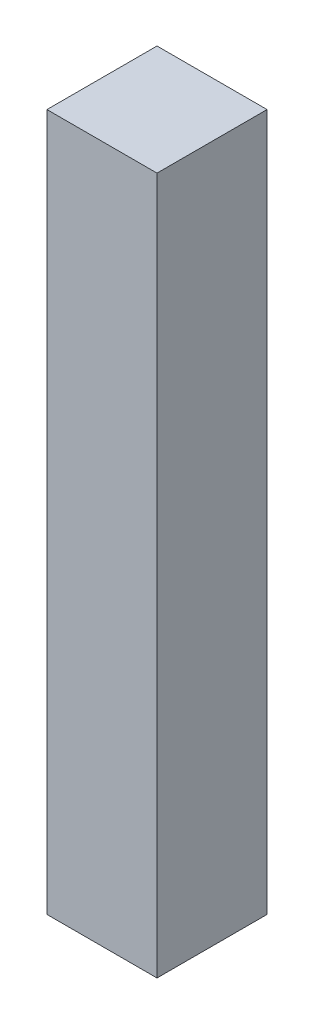
ISO-10303-21;
HEADER;
FILE_DESCRIPTION(('STEP AP214'),'2;1');
FILE_NAME('part.step','',(''),(''),'','','');
FILE_SCHEMA(('AUTOMOTIVE_DESIGN { 1 0 10303 214 1 1 1 1 }'));
ENDSEC;
DATA;
#1=APPLICATION_CONTEXT('core data for automotive mechanical design processes');
#2=APPLICATION_PROTOCOL_DEFINITION('international standard','automotive_design',2000,#1);
#3=PRODUCT_CONTEXT('',#1,'mechanical');
#4=PRODUCT('Part','Part','',(#3));
#5=PRODUCT_RELATED_PRODUCT_CATEGORY('part','',(#4));
#6=PRODUCT_DEFINITION_FORMATION('','',#4);
#7=PRODUCT_DEFINITION_CONTEXT('part definition',#1,'design');
#8=PRODUCT_DEFINITION('design','',#6,#7);
#9=PRODUCT_DEFINITION_SHAPE('','',#8);
#10=(LENGTH_UNIT() NAMED_UNIT(*) SI_UNIT(.MILLI.,.METRE.));
#11=(NAMED_UNIT(*) PLANE_ANGLE_UNIT() SI_UNIT($,.RADIAN.));
#12=(NAMED_UNIT(*) SI_UNIT($,.STERADIAN.) SOLID_ANGLE_UNIT());
#13=UNCERTAINTY_MEASURE_WITH_UNIT(LENGTH_MEASURE(1.E-05),#10,'distance_accuracy_value','');
#14=(GEOMETRIC_REPRESENTATION_CONTEXT(3) GLOBAL_UNCERTAINTY_ASSIGNED_CONTEXT((#13)) GLOBAL_UNIT_ASSIGNED_CONTEXT((#10,
#11,#12)) REPRESENTATION_CONTEXT('',''));
#15=CARTESIAN_POINT('',(0.,0.,0.));
#16=DIRECTION('',(0.,0.,1.));
#17=DIRECTION('',(1.,0.,0.));
#18=AXIS2_PLACEMENT_3D('',#15,#16,#17);
#19=CARTESIAN_POINT('',(15.,190.,15.));
#20=DIRECTION('',(-1.,0.,0.));
#21=DIRECTION('',(0.,0.,1.));
#22=AXIS2_PLACEMENT_3D('',#19,#20,#21);
#23=PLANE('',#22);
#24=DIRECTION('',(0.,0.,-1.));
#25=VECTOR('',#24,1.);
#26=CARTESIAN_POINT('',(15.,0.,15.));
#27=LINE('',#26,#25);
#28=CARTESIAN_POINT('',(15.,0.,15.));
#29=VERTEX_POINT('',#28);
#30=CARTESIAN_POINT('',(15.,0.,-15.));
#31=VERTEX_POINT('',#30);
#32=EDGE_CURVE('E96',#29,#31,#27,.T.);
#33=ORIENTED_EDGE('',*,*,#32,.T.);
#34=DIRECTION('',(0.,-1.,0.));
#35=VECTOR('',#34,1.);
#36=CARTESIAN_POINT('',(15.,190.,-15.));
#37=LINE('',#36,#35);
#38=CARTESIAN_POINT('',(15.,190.,-15.));
#39=VERTEX_POINT('',#38);
#40=EDGE_CURVE('E11',#39,#31,#37,.T.);
#41=ORIENTED_EDGE('',*,*,#40,.F.);
#42=DIRECTION('',(0.,0.,-1.));
#43=VECTOR('',#42,1.);
#44=CARTESIAN_POINT('',(15.,190.,15.));
#45=LINE('',#44,#43);
#46=CARTESIAN_POINT('',(15.,190.,15.));
#47=VERTEX_POINT('',#46);
#48=EDGE_CURVE('E84',#47,#39,#45,.T.);
#49=ORIENTED_EDGE('',*,*,#48,.F.);
#50=DIRECTION('',(0.,-1.,0.));
#51=VECTOR('',#50,1.);
#52=CARTESIAN_POINT('',(15.,190.,15.));
#53=LINE('',#52,#51);
#54=EDGE_CURVE('E92',#47,#29,#53,.T.);
#55=ORIENTED_EDGE('',*,*,#54,.T.);
#56=EDGE_LOOP('',(#33,#41,#49,#55));
#57=FACE_BOUND('',#56,.T.);
#58=ADVANCED_FACE('F33',(#57),#23,.F.);
#59=CARTESIAN_POINT('',(-15.,190.,-15.));
#60=DIRECTION('',(0.,0.,1.));
#61=DIRECTION('',(1.,0.,0.));
#62=AXIS2_PLACEMENT_3D('',#59,#60,#61);
#63=PLANE('',#62);
#64=DIRECTION('',(-1.,0.,0.));
#65=VECTOR('',#64,1.);
#66=CARTESIAN_POINT('',(-15.,0.,-15.));
#67=LINE('',#66,#65);
#68=CARTESIAN_POINT('',(-15.,0.,-15.));
#69=VERTEX_POINT('',#68);
#70=EDGE_CURVE('E88',#31,#69,#67,.T.);
#71=ORIENTED_EDGE('',*,*,#70,.T.);
#72=DIRECTION('',(0.,-1.,0.));
#73=VECTOR('',#72,1.);
#74=CARTESIAN_POINT('',(-15.,190.,-15.));
#75=LINE('',#74,#73);
#76=CARTESIAN_POINT('',(-15.,190.,-15.));
#77=VERTEX_POINT('',#76);
#78=EDGE_CURVE('E41',#77,#69,#75,.T.);
#79=ORIENTED_EDGE('',*,*,#78,.F.);
#80=DIRECTION('',(-1.,0.,0.));
#81=VECTOR('',#80,1.);
#82=CARTESIAN_POINT('',(-15.,190.,-15.));
#83=LINE('',#82,#81);
#84=EDGE_CURVE('E79',#39,#77,#83,.T.);
#85=ORIENTED_EDGE('',*,*,#84,.F.);
#86=ORIENTED_EDGE('',*,*,#40,.T.);
#87=EDGE_LOOP('',(#71,#79,#85,#86));
#88=FACE_BOUND('',#87,.T.);
#89=ADVANCED_FACE('F87',(#88),#63,.F.);
#90=CARTESIAN_POINT('',(-15.,190.,15.));
#91=DIRECTION('',(1.,0.,0.));
#92=DIRECTION('',(0.,0.,-1.));
#93=AXIS2_PLACEMENT_3D('',#90,#91,#92);
#94=PLANE('',#93);
#95=DIRECTION('',(0.,0.,1.));
#96=VECTOR('',#95,1.);
#97=CARTESIAN_POINT('',(-15.,0.,15.));
#98=LINE('',#97,#96);
#99=CARTESIAN_POINT('',(-15.,0.,15.));
#100=VERTEX_POINT('',#99);
#101=EDGE_CURVE('E66',#69,#100,#98,.T.);
#102=ORIENTED_EDGE('',*,*,#101,.T.);
#103=DIRECTION('',(0.,-1.,0.));
#104=VECTOR('',#103,1.);
#105=CARTESIAN_POINT('',(-15.,190.,15.));
#106=LINE('',#105,#104);
#107=CARTESIAN_POINT('',(-15.,190.,15.));
#108=VERTEX_POINT('',#107);
#109=EDGE_CURVE('E89',#108,#100,#106,.T.);
#110=ORIENTED_EDGE('',*,*,#109,.F.);
#111=DIRECTION('',(0.,0.,1.));
#112=VECTOR('',#111,1.);
#113=CARTESIAN_POINT('',(-15.,190.,15.));
#114=LINE('',#113,#112);
#115=EDGE_CURVE('E82',#77,#108,#114,.T.);
#116=ORIENTED_EDGE('',*,*,#115,.F.);
#117=ORIENTED_EDGE('',*,*,#78,.T.);
#118=EDGE_LOOP('',(#102,#110,#116,#117));
#119=FACE_BOUND('',#118,.T.);
#120=ADVANCED_FACE('F90',(#119),#94,.F.);
#121=CARTESIAN_POINT('',(-15.,190.,15.));
#122=DIRECTION('',(0.,0.,-1.));
#123=DIRECTION('',(-1.,0.,0.));
#124=AXIS2_PLACEMENT_3D('',#121,#122,#123);
#125=PLANE('',#124);
#126=DIRECTION('',(1.,0.,0.));
#127=VECTOR('',#126,1.);
#128=CARTESIAN_POINT('',(-15.,0.,15.));
#129=LINE('',#128,#127);
#130=EDGE_CURVE('E72',#100,#29,#129,.T.);
#131=ORIENTED_EDGE('',*,*,#130,.T.);
#132=ORIENTED_EDGE('',*,*,#54,.F.);
#133=DIRECTION('',(1.,0.,0.));
#134=VECTOR('',#133,1.);
#135=CARTESIAN_POINT('',(-15.,190.,15.));
#136=LINE('',#135,#134);
#137=EDGE_CURVE('E49',#108,#47,#136,.T.);
#138=ORIENTED_EDGE('',*,*,#137,.F.);
#139=ORIENTED_EDGE('',*,*,#109,.T.);
#140=EDGE_LOOP('',(#131,#132,#138,#139));
#141=FACE_BOUND('',#140,.T.);
#142=ADVANCED_FACE('F103',(#141),#125,.F.);
#143=CARTESIAN_POINT('',(0.,190.,0.));
#144=DIRECTION('',(0.,-1.,0.));
#145=DIRECTION('',(0.,0.,-1.));
#146=AXIS2_PLACEMENT_3D('',#143,#144,#145);
#147=PLANE('',#146);
#148=ORIENTED_EDGE('',*,*,#48,.T.);
#149=ORIENTED_EDGE('',*,*,#84,.T.);
#150=ORIENTED_EDGE('',*,*,#115,.T.);
#151=ORIENTED_EDGE('',*,*,#137,.T.);
#152=EDGE_LOOP('',(#148,#149,#150,#151));
#153=FACE_BOUND('',#152,.T.);
#154=ADVANCED_FACE('F80',(#153),#147,.F.);
#155=CARTESIAN_POINT('',(0.,0.,0.));
#156=DIRECTION('',(0.,-1.,0.));
#157=DIRECTION('',(0.,0.,-1.));
#158=AXIS2_PLACEMENT_3D('',#155,#156,#157);
#159=PLANE('',#158);
#160=ORIENTED_EDGE('',*,*,#32,.F.);
#161=ORIENTED_EDGE('',*,*,#130,.F.);
#162=ORIENTED_EDGE('',*,*,#101,.F.);
#163=ORIENTED_EDGE('',*,*,#70,.F.);
#164=EDGE_LOOP('',(#160,#161,#162,#163));
#165=FACE_BOUND('',#164,.T.);
#166=ADVANCED_FACE('F106',(#165),#159,.T.);
#167=CLOSED_SHELL('',(#58,#89,#120,#142,#154,#166));
#168=MANIFOLD_SOLID_BREP('B2',#167);
#169=ADVANCED_BREP_SHAPE_REPRESENTATION('',(#18,#168),#14);
#170=SHAPE_DEFINITION_REPRESENTATION(#9,#169);
ENDSEC;
END-ISO-10303-21;
